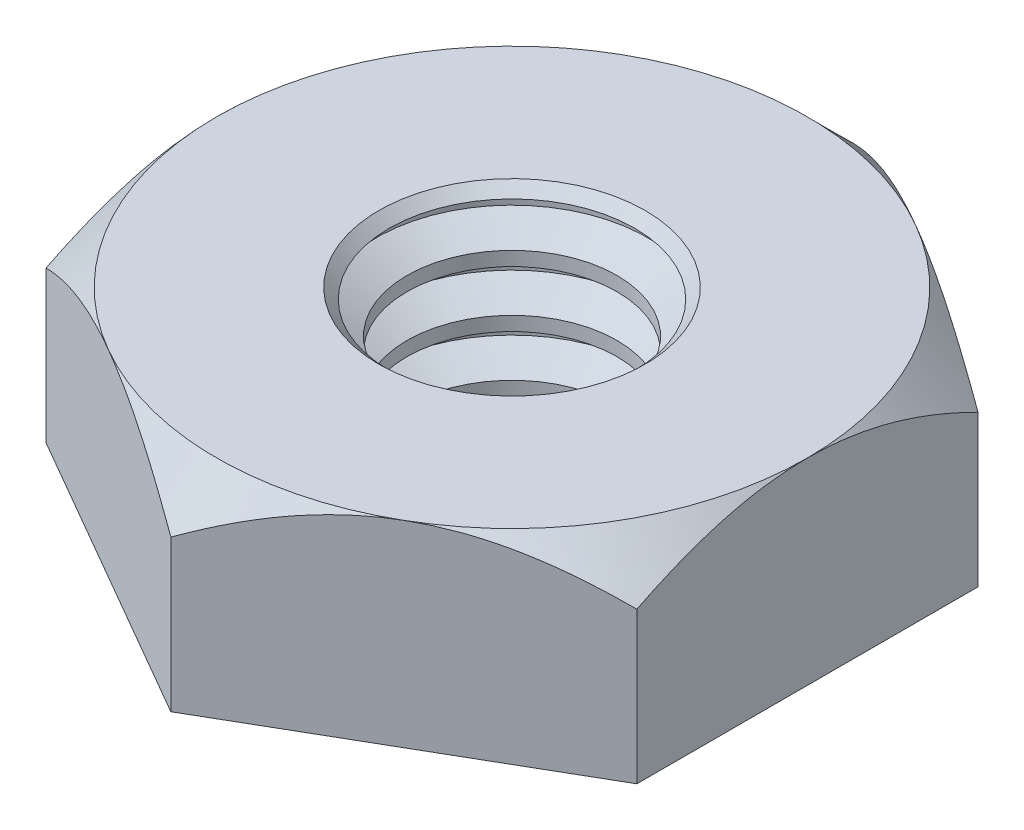
ISO-10303-21;
HEADER;
FILE_DESCRIPTION(('STEP AP214'),'2;1');
FILE_NAME('part.step','',(''),(''),'','','');
FILE_SCHEMA(('AUTOMOTIVE_DESIGN { 1 0 10303 214 1 1 1 1 }'));
ENDSEC;
DATA;
#1=APPLICATION_CONTEXT('core data for automotive mechanical design processes');
#2=APPLICATION_PROTOCOL_DEFINITION('international standard','automotive_design',2000,#1);
#3=PRODUCT_CONTEXT('',#1,'mechanical');
#4=PRODUCT('Part','Part','',(#3));
#5=PRODUCT_RELATED_PRODUCT_CATEGORY('part','',(#4));
#6=PRODUCT_DEFINITION_FORMATION('','',#4);
#7=PRODUCT_DEFINITION_CONTEXT('part definition',#1,'design');
#8=PRODUCT_DEFINITION('design','',#6,#7);
#9=PRODUCT_DEFINITION_SHAPE('','',#8);
#10=(LENGTH_UNIT() NAMED_UNIT(*) SI_UNIT(.MILLI.,.METRE.));
#11=(NAMED_UNIT(*) PLANE_ANGLE_UNIT() SI_UNIT($,.RADIAN.));
#12=(NAMED_UNIT(*) SI_UNIT($,.STERADIAN.) SOLID_ANGLE_UNIT());
#13=UNCERTAINTY_MEASURE_WITH_UNIT(LENGTH_MEASURE(1.E-05),#10,'distance_accuracy_value','');
#14=(GEOMETRIC_REPRESENTATION_CONTEXT(3) GLOBAL_UNCERTAINTY_ASSIGNED_CONTEXT((#13)) GLOBAL_UNIT_ASSIGNED_CONTEXT((#10,
#11,#12)) REPRESENTATION_CONTEXT('',''));
#15=CARTESIAN_POINT('',(0.,0.,0.));
#16=DIRECTION('',(0.,0.,1.));
#17=DIRECTION('',(1.,0.,0.));
#18=AXIS2_PLACEMENT_3D('',#15,#16,#17);
#19=CARTESIAN_POINT('',(0.,0.,-2.7496306570156));
#20=DIRECTION('',(0.,1.,0.));
#21=DIRECTION('',(0.,0.,1.));
#22=AXIS2_PLACEMENT_3D('',#19,#20,#21);
#23=PLANE('',#22);
#24=DIRECTION('',(-0.866025403784439,0.,-0.5));
#25=VECTOR('',#24,1.);
#26=CARTESIAN_POINT('',(2.38125,0.,-1.37481532850781));
#27=LINE('',#26,#25);
#28=CARTESIAN_POINT('',(2.38125,0.,-1.37481532850781));
#29=VERTEX_POINT('',#28);
#30=CARTESIAN_POINT('',(0.,0.,-2.7496306570156));
#31=VERTEX_POINT('',#30);
#32=EDGE_CURVE('E245',#29,#31,#27,.T.);
#33=ORIENTED_EDGE('',*,*,#32,.F.);
#34=DIRECTION('',(0.,0.,-1.));
#35=VECTOR('',#34,1.);
#36=CARTESIAN_POINT('',(2.38125,0.,1.37481532850779));
#37=LINE('',#36,#35);
#38=CARTESIAN_POINT('',(2.38125,0.,1.37481532850779));
#39=VERTEX_POINT('',#38);
#40=EDGE_CURVE('E334',#39,#29,#37,.T.);
#41=ORIENTED_EDGE('',*,*,#40,.F.);
#42=DIRECTION('',(0.866025403784439,0.,-0.5));
#43=VECTOR('',#42,1.);
#44=CARTESIAN_POINT('',(0.,0.,2.74963065701559));
#45=LINE('',#44,#43);
#46=CARTESIAN_POINT('',(0.,0.,2.74963065701559));
#47=VERTEX_POINT('',#46);
#48=EDGE_CURVE('E333',#47,#39,#45,.T.);
#49=ORIENTED_EDGE('',*,*,#48,.F.);
#50=DIRECTION('',(0.866025403784439,0.,0.5));
#51=VECTOR('',#50,1.);
#52=CARTESIAN_POINT('',(-2.38125,0.,1.37481532850779));
#53=LINE('',#52,#51);
#54=CARTESIAN_POINT('',(-2.38125,0.,1.37481532850779));
#55=VERTEX_POINT('',#54);
#56=EDGE_CURVE('E126',#55,#47,#53,.T.);
#57=ORIENTED_EDGE('',*,*,#56,.F.);
#58=DIRECTION('',(0.,0.,1.));
#59=VECTOR('',#58,1.);
#60=CARTESIAN_POINT('',(-2.38125,0.,-1.3748153285078));
#61=LINE('',#60,#59);
#62=CARTESIAN_POINT('',(-2.38125,0.,-1.3748153285078));
#63=VERTEX_POINT('',#62);
#64=EDGE_CURVE('E339',#63,#55,#61,.T.);
#65=ORIENTED_EDGE('',*,*,#64,.F.);
#66=DIRECTION('',(-0.866025403784438,0.,0.500000000000001));
#67=VECTOR('',#66,1.);
#68=CARTESIAN_POINT('',(0.,0.,-2.7496306570156));
#69=LINE('',#68,#67);
#70=EDGE_CURVE('E342',#31,#63,#69,.T.);
#71=ORIENTED_EDGE('',*,*,#70,.F.);
#72=EDGE_LOOP('',(#33,#41,#49,#57,#65,#71));
#73=FACE_BOUND('',#72,.T.);
#74=CARTESIAN_POINT('',(0.,0.,0.));
#75=DIRECTION('',(0.,1.,0.));
#76=DIRECTION('',(0.,0.,1.));
#77=AXIS2_PLACEMENT_3D('',#74,#75,#76);
#78=CIRCLE('',#77,1.04309945255329);
#79=CARTESIAN_POINT('',(0.,0.,1.04309945255329));
#80=VERTEX_POINT('',#79);
#81=EDGE_CURVE('E143',#80,#80,#78,.F.);
#82=ORIENTED_EDGE('',*,*,#81,.F.);
#83=EDGE_LOOP('',(#82));
#84=FACE_BOUND('',#83,.T.);
#85=ADVANCED_FACE('F32',(#73,#84),#23,.F.);
#86=CARTESIAN_POINT('',(0.,1.5875,-2.7496306570156));
#87=DIRECTION('',(0.,1.,0.));
#88=DIRECTION('',(0.,0.,1.));
#89=AXIS2_PLACEMENT_3D('',#86,#87,#88);
#90=PLANE('',#89);
#91=CARTESIAN_POINT('',(0.,1.5875,0.));
#92=DIRECTION('',(0.,1.,0.));
#93=DIRECTION('',(0.,0.,1.));
#94=AXIS2_PLACEMENT_3D('',#91,#92,#93);
#95=CIRCLE('',#94,1.07348297705218);
#96=CARTESIAN_POINT('',(0.,1.5875,1.07348297705218));
#97=VERTEX_POINT('',#96);
#98=EDGE_CURVE('E11',#97,#97,#95,.F.);
#99=ORIENTED_EDGE('',*,*,#98,.T.);
#100=EDGE_LOOP('',(#99));
#101=FACE_BOUND('',#100,.T.);
#102=CARTESIAN_POINT('',(0.,1.5875,0.));
#103=DIRECTION('',(0.,1.,0.));
#104=DIRECTION('',(0.,0.,1.));
#105=AXIS2_PLACEMENT_3D('',#102,#103,#104);
#106=CIRCLE('',#105,2.38125);
#107=CARTESIAN_POINT('',(-1.190625,1.5875,2.06222299276169));
#108=VERTEX_POINT('',#107);
#109=CARTESIAN_POINT('',(1.190625,1.5875,2.06222299276169));
#110=VERTEX_POINT('',#109);
#111=EDGE_CURVE('E108',#108,#110,#106,.T.);
#112=ORIENTED_EDGE('',*,*,#111,.T.);
#113=CARTESIAN_POINT('',(0.,1.5875,0.));
#114=DIRECTION('',(0.,1.,0.));
#115=DIRECTION('',(0.,0.,1.));
#116=AXIS2_PLACEMENT_3D('',#113,#114,#115);
#117=CIRCLE('',#116,2.38125);
#118=CARTESIAN_POINT('',(2.38125,1.5875,0.));
#119=VERTEX_POINT('',#118);
#120=EDGE_CURVE('E48',#110,#119,#117,.T.);
#121=ORIENTED_EDGE('',*,*,#120,.T.);
#122=CARTESIAN_POINT('',(1.190625,1.5875,-2.06222299276169));
#123=VERTEX_POINT('',#122);
#124=EDGE_CURVE('E142',#119,#123,#106,.T.);
#125=ORIENTED_EDGE('',*,*,#124,.T.);
#126=CARTESIAN_POINT('',(-1.190625,1.5875,-2.06222299276169));
#127=VERTEX_POINT('',#126);
#128=EDGE_CURVE('E150',#123,#127,#106,.T.);
#129=ORIENTED_EDGE('',*,*,#128,.T.);
#130=CARTESIAN_POINT('',(-2.38125,1.5875,0.));
#131=VERTEX_POINT('',#130);
#132=EDGE_CURVE('E153',#127,#131,#106,.T.);
#133=ORIENTED_EDGE('',*,*,#132,.T.);
#134=EDGE_CURVE('E141',#131,#108,#106,.T.);
#135=ORIENTED_EDGE('',*,*,#134,.T.);
#136=EDGE_LOOP('',(#112,#121,#125,#129,#133,#135));
#137=FACE_BOUND('',#136,.T.);
#138=ADVANCED_FACE('F160',(#101,#137),#90,.T.);
#139=CARTESIAN_POINT('',(2.38125,1.5875,-1.37481532850781));
#140=DIRECTION('',(-0.5,0.,0.866025403784439));
#141=DIRECTION('',(0.866025403784439,0.,0.5));
#142=AXIS2_PLACEMENT_3D('',#139,#140,#141);
#143=PLANE('',#142);
#144=CARTESIAN_POINT('',(2.38145,1.21900386565717,-1.37469985845397));
#145=CARTESIAN_POINT('',(2.29959321762095,1.26622444627487,-1.42195989379551));
#146=CARTESIAN_POINT('',(2.21636766622824,1.31067176769151,-1.47001018829555));
#147=CARTESIAN_POINT('',(2.04666151916196,1.39205388599882,-1.5679900779874));
#148=CARTESIAN_POINT('',(1.96016478264689,1.42894339988927,-1.61792899209839));
#149=CARTESIAN_POINT('',(1.78574822599095,1.4921359298185,-1.71862843803483));
#150=CARTESIAN_POINT('',(1.69787282881932,1.51859778425492,-1.76936332224702));
#151=CARTESIAN_POINT('',(1.52018740592912,1.55936782736834,-1.87195004898375));
#152=CARTESIAN_POINT('',(1.43038280881412,1.57370645145385,-1.92379875730256));
#153=CARTESIAN_POINT('',(1.27561039686965,1.58664355821429,-2.01315665100182));
#154=CARTESIAN_POINT('',(1.21084255103038,1.58855873833122,-2.05055038423196));
#155=CARTESIAN_POINT('',(1.08141272066442,1.58533272021672,-2.12527673163492));
#156=CARTESIAN_POINT('',(1.01675078120663,1.58018904812731,-2.16260931978719));
#157=CARTESIAN_POINT('',(0.888037451422591,1.56313803211276,-2.2369219953863));
#158=CARTESIAN_POINT('',(0.823986825765133,1.55122312163506,-2.2739016413514));
#159=CARTESIAN_POINT('',(0.696993161094712,1.52128367063236,-2.34722146783424));
#160=CARTESIAN_POINT('',(0.63405003756416,1.50325959846594,-2.38356169714824));
#161=CARTESIAN_POINT('',(0.472823849267805,1.44975053543199,-2.47664568036156));
#162=CARTESIAN_POINT('',(0.37554050871215,1.41023192211222,-2.53281224321903));
#163=CARTESIAN_POINT('',(0.232493937374424,1.3435189994336,-2.61540021968752));
#164=CARTESIAN_POINT('',(0.185353711056031,1.32007913387306,-2.64261664204211));
#165=CARTESIAN_POINT('',(0.0919464736333594,1.27106266632487,-2.69654533571235));
#166=CARTESIAN_POINT('',(0.0456789475031774,1.24548737621755,-2.72325790437834));
#167=CARTESIAN_POINT('',(-0.000199999999999734,1.21900386565717,-2.74974612706944));
#168=B_SPLINE_CURVE_WITH_KNOTS('',3,(#144,#145,#146,#147,#148,#149,#150,#151,#152,#153,#154,
#155,#156,#157,#158,#159,#160,#161,#162,#163,#164,#165,#166,#167),.UNSPECIFIED.,.F.,.F.,(4,2,2,
2,2,2,2,2,2,2,2,4),(0.,0.317196610611949,0.636241461041219,0.950218950629223,1.26340583824126,
1.48752413747844,1.71172100167748,1.93616888974083,2.16059957440838,2.51709639744763,
2.69486147369099,2.87251813383153),.UNSPECIFIED.);
#169=CARTESIAN_POINT('',(2.38125,1.2191193429844,-1.37481532850782));
#170=VERTEX_POINT('',#169);
#171=EDGE_CURVE('E344',#170,#123,#168,.T.);
#172=ORIENTED_EDGE('',*,*,#171,.F.);
#173=DIRECTION('',(0.,-1.,0.));
#174=VECTOR('',#173,1.);
#175=CARTESIAN_POINT('',(2.38125,1.5875,-1.37481532850781));
#176=LINE('',#175,#174);
#177=EDGE_CURVE('E133',#170,#29,#176,.T.);
#178=ORIENTED_EDGE('',*,*,#177,.T.);
#179=ORIENTED_EDGE('',*,*,#32,.T.);
#180=DIRECTION('',(0.,-1.,0.));
#181=VECTOR('',#180,1.);
#182=CARTESIAN_POINT('',(0.,1.5875,-2.7496306570156));
#183=LINE('',#182,#181);
#184=CARTESIAN_POINT('',(0.,1.2191193429844,-2.7496306570156));
#185=VERTEX_POINT('',#184);
#186=EDGE_CURVE('E138',#185,#31,#183,.T.);
#187=ORIENTED_EDGE('',*,*,#186,.F.);
#188=EDGE_CURVE('E216',#123,#185,#168,.T.);
#189=ORIENTED_EDGE('',*,*,#188,.F.);
#190=EDGE_LOOP('',(#172,#178,#179,#187,#189));
#191=FACE_BOUND('',#190,.T.);
#192=ADVANCED_FACE('F34',(#191),#143,.F.);
#193=CARTESIAN_POINT('',(0.,1.5875,-2.7496306570156));
#194=DIRECTION('',(0.500000000000001,0.,0.866025403784438));
#195=DIRECTION('',(0.866025403784438,0.,-0.500000000000001));
#196=AXIS2_PLACEMENT_3D('',#193,#194,#195);
#197=PLANE('',#196);
#198=CARTESIAN_POINT('',(0.000200000000000166,1.21900386565717,-2.74974612706944));
#199=CARTESIAN_POINT('',(-0.0816567823790508,1.26622444627487,-2.7024860917279));
#200=CARTESIAN_POINT('',(-0.164882333771762,1.31067176769151,-2.65443579722786));
#201=CARTESIAN_POINT('',(-0.334588480838043,1.39205388599882,-2.55645590753601));
#202=CARTESIAN_POINT('',(-0.421085217353107,1.42894339988927,-2.50651699342501));
#203=CARTESIAN_POINT('',(-0.595501774009049,1.49213592981849,-2.40581754748858));
#204=CARTESIAN_POINT('',(-0.683377171180682,1.51859778425492,-2.35508266327639));
#205=CARTESIAN_POINT('',(-0.861062594070885,1.55936782736834,-2.25249593653966));
#206=CARTESIAN_POINT('',(-0.950867191185882,1.57370645145385,-2.20064722822085));
#207=CARTESIAN_POINT('',(-1.10563960313035,1.58664355821429,-2.11128933452158));
#208=CARTESIAN_POINT('',(-1.17040744896963,1.58855873833122,-2.07389560129144));
#209=CARTESIAN_POINT('',(-1.29983727933559,1.58533272021672,-1.99916925388849));
#210=CARTESIAN_POINT('',(-1.36449921879337,1.58018904812731,-1.96183666573621));
#211=CARTESIAN_POINT('',(-1.49321254857742,1.56313803211276,-1.8875239901371));
#212=CARTESIAN_POINT('',(-1.55726317423487,1.55122312163507,-1.85054434417201));
#213=CARTESIAN_POINT('',(-1.68425683890529,1.52128367063237,-1.77722451768916));
#214=CARTESIAN_POINT('',(-1.74719996243585,1.50325959846595,-1.74088428837516));
#215=CARTESIAN_POINT('',(-1.9084261507322,1.44975053543199,-1.64780030516184));
#216=CARTESIAN_POINT('',(-2.00570949128785,1.41023192211222,-1.59163374230437));
#217=CARTESIAN_POINT('',(-2.14875606262558,1.3435189994336,-1.50904576583588));
#218=CARTESIAN_POINT('',(-2.19589628894397,1.32007913387307,-1.4818293434813));
#219=CARTESIAN_POINT('',(-2.28930352636664,1.27106266632487,-1.42790064981106));
#220=CARTESIAN_POINT('',(-2.33557105249682,1.24548737621755,-1.40118808114506));
#221=CARTESIAN_POINT('',(-2.38145,1.21900386565717,-1.37469985845397));
#222=B_SPLINE_CURVE_WITH_KNOTS('',3,(#198,#199,#200,#201,#202,#203,#204,#205,#206,#207,#208,
#209,#210,#211,#212,#213,#214,#215,#216,#217,#218,#219,#220,#221),.UNSPECIFIED.,.F.,.F.,(4,2,2,
2,2,2,2,2,2,2,2,4),(0.,0.317196610611952,0.636241461041225,0.950218950629232,1.26340583824127,
1.48752413747846,1.71172100167749,1.93616888974084,2.16059957440839,2.51709639744764,
2.694861473691,2.87251813383154),.UNSPECIFIED.);
#223=EDGE_CURVE('E215',#185,#127,#222,.T.);
#224=ORIENTED_EDGE('',*,*,#223,.F.);
#225=ORIENTED_EDGE('',*,*,#186,.T.);
#226=ORIENTED_EDGE('',*,*,#70,.T.);
#227=DIRECTION('',(0.,-1.,0.));
#228=VECTOR('',#227,1.);
#229=CARTESIAN_POINT('',(-2.38125,1.5875,-1.3748153285078));
#230=LINE('',#229,#228);
#231=CARTESIAN_POINT('',(-2.38125,1.2191193429844,-1.37481532850781));
#232=VERTEX_POINT('',#231);
#233=EDGE_CURVE('E131',#232,#63,#230,.T.);
#234=ORIENTED_EDGE('',*,*,#233,.F.);
#235=EDGE_CURVE('E210',#127,#232,#222,.T.);
#236=ORIENTED_EDGE('',*,*,#235,.F.);
#237=EDGE_LOOP('',(#224,#225,#226,#234,#236));
#238=FACE_BOUND('',#237,.T.);
#239=ADVANCED_FACE('F222',(#238),#197,.F.);
#240=CARTESIAN_POINT('',(-2.38125,1.5875,-1.3748153285078));
#241=DIRECTION('',(1.,0.,0.));
#242=DIRECTION('',(0.,0.,-1.));
#243=AXIS2_PLACEMENT_3D('',#240,#241,#242);
#244=PLANE('',#243);
#245=CARTESIAN_POINT('',(-2.38125,0.240179588906181,-2.86912630394419));
#246=CARTESIAN_POINT('',(-2.38125,0.293506689126681,-2.79980955592461));
#247=CARTESIAN_POINT('',(-2.38125,0.346355938633444,-2.7301193164531));
#248=CARTESIAN_POINT('',(-2.38125,0.450880424075711,-2.58983919614982));
#249=CARTESIAN_POINT('',(-2.38125,0.502555379296196,-2.51924910637501));
#250=CARTESIAN_POINT('',(-2.38125,0.604880705975389,-2.37650077502422));
#251=CARTESIAN_POINT('',(-2.38125,0.655520097364171,-2.30433463685783));
#252=CARTESIAN_POINT('',(-2.38125,0.755036614291812,-2.15880130547659));
#253=CARTESIAN_POINT('',(-2.38125,0.803913861173311,-2.08543419546942));
#254=CARTESIAN_POINT('',(-2.38125,0.902542961805656,-1.93258845780627));
#255=CARTESIAN_POINT('',(-2.38125,0.952152910200805,-1.85301779850509));
#256=CARTESIAN_POINT('',(-2.38125,1.04827866709485,-1.69203159559179));
#257=CARTESIAN_POINT('',(-2.38125,1.09479487864361,-1.61061629415846));
#258=CARTESIAN_POINT('',(-2.38125,1.18376557525143,-1.44588343133112));
#259=CARTESIAN_POINT('',(-2.38125,1.22623141970181,-1.36257205340724));
#260=CARTESIAN_POINT('',(-2.38125,1.30614212570996,-1.19359416640859));
#261=CARTESIAN_POINT('',(-2.38125,1.34358935588907,-1.10792879151245));
#262=CARTESIAN_POINT('',(-2.38125,1.40872452306872,-0.942635039086768));
#263=CARTESIAN_POINT('',(-2.38125,1.4370108001417,-0.86324486347623));
#264=CARTESIAN_POINT('',(-2.38125,1.48722865765993,-0.702441892782966));
#265=CARTESIAN_POINT('',(-2.38125,1.50915983334739,-0.621028969229365));
#266=CARTESIAN_POINT('',(-2.38125,1.54511481952273,-0.458084644425686));
#267=CARTESIAN_POINT('',(-2.38125,1.55928224783569,-0.376585475438002));
#268=CARTESIAN_POINT('',(-2.38125,1.57941416514849,-0.212574622282762));
#269=CARTESIAN_POINT('',(-2.38125,1.5853803560254,-0.1300631517693));
#270=CARTESIAN_POINT('',(-2.38125,1.58860164225672,0.031522259858205));
#271=CARTESIAN_POINT('',(-2.38125,1.58622590278112,0.110588903174689));
#272=CARTESIAN_POINT('',(-2.38125,1.5737417806567,0.268104622589961));
#273=CARTESIAN_POINT('',(-2.38125,1.56363269564102,0.346553641940321));
#274=CARTESIAN_POINT('',(-2.38125,1.53608239112472,0.503598587723649));
#275=CARTESIAN_POINT('',(-2.38125,1.51851172190116,0.582171453187212));
#276=CARTESIAN_POINT('',(-2.38125,1.47701024838173,0.737578750449081));
#277=CARTESIAN_POINT('',(-2.38125,1.45307980531335,0.814413280713858));
#278=CARTESIAN_POINT('',(-2.38125,1.37028997046201,1.05086897592276));
#279=CARTESIAN_POINT('',(-2.38125,1.30223450438981,1.20728049738153));
#280=CARTESIAN_POINT('',(-2.38125,1.18870821735986,1.43619844948697));
#281=CARTESIAN_POINT('',(-2.38125,1.14887086566416,1.51169480576284));
#282=CARTESIAN_POINT('',(-2.38125,1.0661066438325,1.6609787360797));
#283=CARTESIAN_POINT('',(-2.38125,1.02318031702828,1.73476660762932));
#284=CARTESIAN_POINT('',(-2.38125,0.937038433864163,1.87722638325708));
#285=CARTESIAN_POINT('',(-2.38125,0.893941790031278,1.94597101003489));
#286=CARTESIAN_POINT('',(-2.38125,0.805912978151154,2.08228069367819));
#287=CARTESIAN_POINT('',(-2.38125,0.760980672486613,2.14984566156212));
#288=CARTESIAN_POINT('',(-2.38125,0.669974823916356,2.2834054266231));
#289=CARTESIAN_POINT('',(-2.38125,0.62391334034527,2.34940847508033));
#290=CARTESIAN_POINT('',(-2.38125,0.53055562575305,2.48050909903297));
#291=CARTESIAN_POINT('',(-2.38125,0.483259738608898,2.54560691911997));
#292=CARTESIAN_POINT('',(-2.38125,0.435458445142948,2.61032519987917));
#293=B_SPLINE_CURVE_WITH_KNOTS('',3,(#245,#246,#247,#248,#249,#250,#251,#252,#253,#254,#255,
#256,#257,#258,#259,#260,#261,#262,#263,#264,#265,#266,#267,#268,#269,#270,#271,#272,#273,#274,
#275,#276,#277,#278,#279,#280,#281,#282,#283,#284,#285,#286,#287,#288,#289,#290,#291,#292),
.UNSPECIFIED.,.F.,.F.,(4,2,2,2,2,2,2,2,2,2,2,2,2,2,2,2,2,2,2,2,2,2,2,4),(0.,0.262373486076588,
0.524809046422166,0.789269246638219,1.05371120100018,1.33496294182564,1.61617796930576,
1.89657958024649,2.17684838122958,2.42946682102386,2.68210134660699,2.92988953986813,
3.17762630567771,3.41454048769348,3.65147618955809,3.89270212574338,4.13391436351259,
4.64406226241705,4.90012722407799,5.15614725506489,5.39952730752342,5.64292563948722,
5.88436975409123,6.12574731099199),.UNSPECIFIED.);
#294=EDGE_CURVE('E165',#232,#131,#293,.T.);
#295=ORIENTED_EDGE('',*,*,#294,.F.);
#296=ORIENTED_EDGE('',*,*,#233,.T.);
#297=ORIENTED_EDGE('',*,*,#64,.T.);
#298=DIRECTION('',(0.,-1.,0.));
#299=VECTOR('',#298,1.);
#300=CARTESIAN_POINT('',(-2.38125,1.5875,1.37481532850779));
#301=LINE('',#300,#299);
#302=CARTESIAN_POINT('',(-2.38125000000002,1.2191193429844,1.37481532850778));
#303=VERTEX_POINT('',#302);
#304=EDGE_CURVE('E128',#303,#55,#301,.T.);
#305=ORIENTED_EDGE('',*,*,#304,.F.);
#306=EDGE_CURVE('E163',#131,#303,#293,.T.);
#307=ORIENTED_EDGE('',*,*,#306,.F.);
#308=EDGE_LOOP('',(#295,#296,#297,#305,#307));
#309=FACE_BOUND('',#308,.T.);
#310=ADVANCED_FACE('F225',(#309),#244,.F.);
#311=CARTESIAN_POINT('',(-2.38125,1.5875,1.37481532850779));
#312=DIRECTION('',(0.5,0.,-0.866025403784439));
#313=DIRECTION('',(-0.866025403784439,0.,-0.5));
#314=AXIS2_PLACEMENT_3D('',#311,#312,#313);
#315=PLANE('',#314);
#316=CARTESIAN_POINT('',(-2.38145,1.21900386565718,1.37469985845395));
#317=CARTESIAN_POINT('',(-2.29959321762095,1.26622444627488,1.4219598937955));
#318=CARTESIAN_POINT('',(-2.21636766622824,1.31067176769152,1.47001018829553));
#319=CARTESIAN_POINT('',(-2.04666151916196,1.39205388599883,1.56799007798738));
#320=CARTESIAN_POINT('',(-1.9601647826469,1.42894339988927,1.61792899209838));
#321=CARTESIAN_POINT('',(-1.78574822599096,1.4921359298185,1.71862843803482));
#322=CARTESIAN_POINT('',(-1.69787282881932,1.51859778425493,1.769363322247));
#323=CARTESIAN_POINT('',(-1.52018740592912,1.55936782736835,1.87195004898373));
#324=CARTESIAN_POINT('',(-1.43038280881412,1.57370645145386,1.92379875730254));
#325=CARTESIAN_POINT('',(-1.27561039686965,1.5866435582143,2.01315665100181));
#326=CARTESIAN_POINT('',(-1.21084255103038,1.58855873833123,2.05055038423195));
#327=CARTESIAN_POINT('',(-1.08141272066442,1.58533272021673,2.1252767316349));
#328=CARTESIAN_POINT('',(-1.01675078120664,1.58018904812732,2.16260931978718));
#329=CARTESIAN_POINT('',(-0.888037451422593,1.56313803211277,2.23692199538629));
#330=CARTESIAN_POINT('',(-0.823986825765135,1.55122312163508,2.27390164135138));
#331=CARTESIAN_POINT('',(-0.696993161094714,1.52128367063238,2.34722146783423));
#332=CARTESIAN_POINT('',(-0.634050037564163,1.50325959846596,2.38356169714823));
#333=CARTESIAN_POINT('',(-0.472823849267807,1.449750535432,2.47664568036155));
#334=CARTESIAN_POINT('',(-0.375540508712152,1.41023192211223,2.53281224321902));
#335=CARTESIAN_POINT('',(-0.232493937374426,1.34351899943361,2.61540021968751));
#336=CARTESIAN_POINT('',(-0.185353711056032,1.32007913387308,2.64261664204209));
#337=CARTESIAN_POINT('',(-0.0919464736333602,1.27106266632488,2.69654533571233));
#338=CARTESIAN_POINT('',(-0.045678947503178,1.24548737621756,2.72325790437833));
#339=CARTESIAN_POINT('',(0.000199999999999358,1.21900386565718,2.74974612706943));
#340=B_SPLINE_CURVE_WITH_KNOTS('',3,(#316,#317,#318,#319,#320,#321,#322,#323,#324,#325,#326,
#327,#328,#329,#330,#331,#332,#333,#334,#335,#336,#337,#338,#339),.UNSPECIFIED.,.F.,.F.,(4,2,2,
2,2,2,2,2,2,2,2,4),(0.,0.317196610611951,0.636241461041222,0.950218950629227,1.26340583824127,
1.48752413747845,1.71172100167748,1.93616888974083,2.16059957440838,2.51709639744764,
2.69486147369099,2.87251813383154),.UNSPECIFIED.);
#341=EDGE_CURVE('E113',#303,#108,#340,.T.);
#342=ORIENTED_EDGE('',*,*,#341,.F.);
#343=ORIENTED_EDGE('',*,*,#304,.T.);
#344=ORIENTED_EDGE('',*,*,#56,.T.);
#345=DIRECTION('',(0.,-1.,0.));
#346=VECTOR('',#345,1.);
#347=CARTESIAN_POINT('',(0.,1.5875,2.74963065701559));
#348=LINE('',#347,#346);
#349=CARTESIAN_POINT('',(0.,1.2191193429844,2.7496306570156));
#350=VERTEX_POINT('',#349);
#351=EDGE_CURVE('E119',#350,#47,#348,.T.);
#352=ORIENTED_EDGE('',*,*,#351,.F.);
#353=EDGE_CURVE('E104',#108,#350,#340,.T.);
#354=ORIENTED_EDGE('',*,*,#353,.F.);
#355=EDGE_LOOP('',(#342,#343,#344,#352,#354));
#356=FACE_BOUND('',#355,.T.);
#357=ADVANCED_FACE('F124',(#356),#315,.F.);
#358=CARTESIAN_POINT('',(0.,1.5875,2.74963065701559));
#359=DIRECTION('',(-0.5,0.,-0.866025403784439));
#360=DIRECTION('',(-0.866025403784439,0.,0.5));
#361=AXIS2_PLACEMENT_3D('',#358,#359,#360);
#362=PLANE('',#361);
#363=CARTESIAN_POINT('',(-0.000200000000000334,1.21900386565718,2.74974612706943));
#364=CARTESIAN_POINT('',(0.0816567823790502,1.26622444627488,2.70248609172789));
#365=CARTESIAN_POINT('',(0.164882333771761,1.31067176769152,2.65443579722785));
#366=CARTESIAN_POINT('',(0.334588480838041,1.39205388599883,2.556455907536));
#367=CARTESIAN_POINT('',(0.421085217353105,1.42894339988928,2.506516993425));
#368=CARTESIAN_POINT('',(0.595501774009046,1.49213592981851,2.40581754748857));
#369=CARTESIAN_POINT('',(0.683377171180678,1.51859778425493,2.35508266327638));
#370=CARTESIAN_POINT('',(0.86106259407088,1.55936782736835,2.25249593653965));
#371=CARTESIAN_POINT('',(0.950867191185876,1.57370645145386,2.20064722822084));
#372=CARTESIAN_POINT('',(1.10563960313035,1.5866435582143,2.11128933452157));
#373=CARTESIAN_POINT('',(1.17040744896962,1.58855873833123,2.07389560129143));
#374=CARTESIAN_POINT('',(1.29983727933558,1.58533272021673,1.99916925388848));
#375=CARTESIAN_POINT('',(1.36449921879336,1.58018904812732,1.96183666573621));
#376=CARTESIAN_POINT('',(1.49321254857741,1.56313803211277,1.8875239901371));
#377=CARTESIAN_POINT('',(1.55726317423487,1.55122312163508,1.850544344172));
#378=CARTESIAN_POINT('',(1.68425683890529,1.52128367063238,1.77722451768916));
#379=CARTESIAN_POINT('',(1.74719996243584,1.50325959846596,1.74088428837516));
#380=CARTESIAN_POINT('',(1.90842615073219,1.449750535432,1.64780030516184));
#381=CARTESIAN_POINT('',(2.00570949128785,1.41023192211223,1.59163374230436));
#382=CARTESIAN_POINT('',(2.14875606262557,1.34351899943361,1.50904576583587));
#383=CARTESIAN_POINT('',(2.19589628894397,1.32007913387308,1.48182934348129));
#384=CARTESIAN_POINT('',(2.28930352636664,1.27106266632488,1.42790064981105));
#385=CARTESIAN_POINT('',(2.33557105249682,1.24548737621756,1.40118808114505));
#386=CARTESIAN_POINT('',(2.38145,1.21900386565718,1.37469985845396));
#387=B_SPLINE_CURVE_WITH_KNOTS('',3,(#363,#364,#365,#366,#367,#368,#369,#370,#371,#372,#373,
#374,#375,#376,#377,#378,#379,#380,#381,#382,#383,#384,#385,#386),.UNSPECIFIED.,.F.,.F.,(4,2,2,
2,2,2,2,2,2,2,2,4),(0.,0.31719661061195,0.636241461041222,0.950218950629226,1.26340583824126,
1.48752413747845,1.71172100167748,1.93616888974083,2.16059957440838,2.51709639744763,
2.69486147369099,2.87251813383153),.UNSPECIFIED.);
#388=EDGE_CURVE('E107',#350,#110,#387,.T.);
#389=ORIENTED_EDGE('',*,*,#388,.F.);
#390=ORIENTED_EDGE('',*,*,#351,.T.);
#391=ORIENTED_EDGE('',*,*,#48,.T.);
#392=DIRECTION('',(0.,-1.,0.));
#393=VECTOR('',#392,1.);
#394=CARTESIAN_POINT('',(2.38125,1.5875,1.37481532850779));
#395=LINE('',#394,#393);
#396=CARTESIAN_POINT('',(2.38125,1.2191193429844,1.37481532850782));
#397=VERTEX_POINT('',#396);
#398=EDGE_CURVE('E129',#397,#39,#395,.T.);
#399=ORIENTED_EDGE('',*,*,#398,.F.);
#400=EDGE_CURVE('E122',#110,#397,#387,.T.);
#401=ORIENTED_EDGE('',*,*,#400,.F.);
#402=EDGE_LOOP('',(#389,#390,#391,#399,#401));
#403=FACE_BOUND('',#402,.T.);
#404=ADVANCED_FACE('F117',(#403),#362,.F.);
#405=CARTESIAN_POINT('',(2.38125,1.5875,1.37481532850779));
#406=DIRECTION('',(-1.,0.,0.));
#407=DIRECTION('',(0.,0.,1.));
#408=AXIS2_PLACEMENT_3D('',#405,#406,#407);
#409=PLANE('',#408);
#410=CARTESIAN_POINT('',(2.38125,0.240179588906176,-2.8691263039442));
#411=CARTESIAN_POINT('',(2.38125,0.293506689126676,-2.79980955592462));
#412=CARTESIAN_POINT('',(2.38125,0.346355938633439,-2.73011931645311));
#413=CARTESIAN_POINT('',(2.38125,0.450880424075706,-2.58983919614982));
#414=CARTESIAN_POINT('',(2.38125,0.502555379296192,-2.51924910637502));
#415=CARTESIAN_POINT('',(2.38125,0.604880705975386,-2.37650077502423));
#416=CARTESIAN_POINT('',(2.38125,0.655520097364168,-2.30433463685784));
#417=CARTESIAN_POINT('',(2.38125,0.755036614291809,-2.1588013054766));
#418=CARTESIAN_POINT('',(2.38125,0.803913861173308,-2.08543419546942));
#419=CARTESIAN_POINT('',(2.38125,0.902542961805654,-1.93258845780627));
#420=CARTESIAN_POINT('',(2.38125,0.952152910200804,-1.8530177985051));
#421=CARTESIAN_POINT('',(2.38125,1.04827866709485,-1.69203159559179));
#422=CARTESIAN_POINT('',(2.38125,1.09479487864361,-1.61061629415846));
#423=CARTESIAN_POINT('',(2.38125,1.18376557525143,-1.44588343133113));
#424=CARTESIAN_POINT('',(2.38125,1.22623141970181,-1.36257205340725));
#425=CARTESIAN_POINT('',(2.38125,1.30614212570997,-1.19359416640859));
#426=CARTESIAN_POINT('',(2.38125,1.34358935588908,-1.10792879151245));
#427=CARTESIAN_POINT('',(2.38125,1.40872452306873,-0.942635039086772));
#428=CARTESIAN_POINT('',(2.38125,1.43701080014171,-0.863244863476234));
#429=CARTESIAN_POINT('',(2.38125,1.48722865765993,-0.70244189278297));
#430=CARTESIAN_POINT('',(2.38125,1.50915983334739,-0.621028969229369));
#431=CARTESIAN_POINT('',(2.38125,1.54511481952273,-0.45808464442569));
#432=CARTESIAN_POINT('',(2.38125,1.55928224783569,-0.376585475438006));
#433=CARTESIAN_POINT('',(2.38125,1.57941416514849,-0.212574622282766));
#434=CARTESIAN_POINT('',(2.38125,1.58538035602541,-0.130063151769303));
#435=CARTESIAN_POINT('',(2.38125,1.58860164225672,0.0315222598582019));
#436=CARTESIAN_POINT('',(2.38125,1.58622590278112,0.110588903174686));
#437=CARTESIAN_POINT('',(2.38125,1.5737417806567,0.268104622589958));
#438=CARTESIAN_POINT('',(2.38125,1.56363269564102,0.346553641940318));
#439=CARTESIAN_POINT('',(2.38125,1.53608239112472,0.503598587723646));
#440=CARTESIAN_POINT('',(2.38125,1.51851172190117,0.58217145318721));
#441=CARTESIAN_POINT('',(2.38125,1.47701024838173,0.737578750449078));
#442=CARTESIAN_POINT('',(2.38125,1.45307980531336,0.814413280713856));
#443=CARTESIAN_POINT('',(2.38125,1.37028997046202,1.05086897592276));
#444=CARTESIAN_POINT('',(2.38125,1.30223450438981,1.20728049738153));
#445=CARTESIAN_POINT('',(2.38125,1.18870821735987,1.43619844948697));
#446=CARTESIAN_POINT('',(2.38125,1.14887086566416,1.51169480576284));
#447=CARTESIAN_POINT('',(2.38125,1.06610664383251,1.66097873607969));
#448=CARTESIAN_POINT('',(2.38125,1.02318031702829,1.73476660762932));
#449=CARTESIAN_POINT('',(2.38125,0.93703843386417,1.87722638325707));
#450=CARTESIAN_POINT('',(2.38125,0.893941790031285,1.94597101003488));
#451=CARTESIAN_POINT('',(2.38125,0.805912978151162,2.08228069367818));
#452=CARTESIAN_POINT('',(2.38125,0.76098067248662,2.14984566156211));
#453=CARTESIAN_POINT('',(2.38125,0.669974823916364,2.28340542662309));
#454=CARTESIAN_POINT('',(2.38125,0.623913340345278,2.34940847508032));
#455=CARTESIAN_POINT('',(2.38125,0.530555625753058,2.48050909903296));
#456=CARTESIAN_POINT('',(2.38125,0.483259738608906,2.54560691911996));
#457=CARTESIAN_POINT('',(2.38125,0.435458445142958,2.61032519987917));
#458=B_SPLINE_CURVE_WITH_KNOTS('',3,(#410,#411,#412,#413,#414,#415,#416,#417,#418,#419,#420,
#421,#422,#423,#424,#425,#426,#427,#428,#429,#430,#431,#432,#433,#434,#435,#436,#437,#438,#439,
#440,#441,#442,#443,#444,#445,#446,#447,#448,#449,#450,#451,#452,#453,#454,#455,#456,#457),
.UNSPECIFIED.,.F.,.F.,(4,2,2,2,2,2,2,2,2,2,2,2,2,2,2,2,2,2,2,2,2,2,2,4),(0.,0.26237348607659,
0.524809046422169,0.789269246638222,1.05371120100018,1.33496294182565,1.61617796930576,
1.8965795802465,2.17684838122959,2.42946682102387,2.682101346607,2.92988953986814,
3.17762630567772,3.41454048769349,3.6514761895581,3.89270212574339,4.1339143635126,
4.64406226241706,4.900127224078,5.1561472550649,5.39952730752343,5.64292563948723,
5.88436975409124,6.125747310992),.UNSPECIFIED.);
#459=EDGE_CURVE('E325',#397,#119,#458,.F.);
#460=ORIENTED_EDGE('',*,*,#459,.F.);
#461=ORIENTED_EDGE('',*,*,#398,.T.);
#462=ORIENTED_EDGE('',*,*,#40,.T.);
#463=ORIENTED_EDGE('',*,*,#177,.F.);
#464=EDGE_CURVE('E199',#119,#170,#458,.F.);
#465=ORIENTED_EDGE('',*,*,#464,.F.);
#466=EDGE_LOOP('',(#460,#461,#462,#463,#465));
#467=FACE_BOUND('',#466,.T.);
#468=ADVANCED_FACE('F330',(#467),#409,.F.);
#469=CARTESIAN_POINT('',(0.,1.5875,0.));
#470=DIRECTION('',(0.,-1.,0.));
#471=DIRECTION('',(0.,0.,-1.));
#472=AXIS2_PLACEMENT_3D('',#469,#470,#471);
#473=CONICAL_SURFACE('',#472,2.38125,0.785398163397455);
#474=ORIENTED_EDGE('',*,*,#353,.T.);
#475=ORIENTED_EDGE('',*,*,#388,.T.);
#476=ORIENTED_EDGE('',*,*,#111,.F.);
#477=EDGE_LOOP('',(#474,#475,#476));
#478=FACE_BOUND('',#477,.T.);
#479=ADVANCED_FACE('F106',(#478),#473,.T.);
#480=ORIENTED_EDGE('',*,*,#306,.T.);
#481=ORIENTED_EDGE('',*,*,#341,.T.);
#482=ORIENTED_EDGE('',*,*,#134,.F.);
#483=EDGE_LOOP('',(#480,#481,#482));
#484=FACE_BOUND('',#483,.T.);
#485=ADVANCED_FACE('F162',(#484),#473,.T.);
#486=ORIENTED_EDGE('',*,*,#235,.T.);
#487=ORIENTED_EDGE('',*,*,#294,.T.);
#488=ORIENTED_EDGE('',*,*,#132,.F.);
#489=EDGE_LOOP('',(#486,#487,#488));
#490=FACE_BOUND('',#489,.T.);
#491=ADVANCED_FACE('F350',(#490),#473,.T.);
#492=ORIENTED_EDGE('',*,*,#188,.T.);
#493=ORIENTED_EDGE('',*,*,#223,.T.);
#494=ORIENTED_EDGE('',*,*,#128,.F.);
#495=EDGE_LOOP('',(#492,#493,#494));
#496=FACE_BOUND('',#495,.T.);
#497=ADVANCED_FACE('F192',(#496),#473,.T.);
#498=ORIENTED_EDGE('',*,*,#171,.T.);
#499=ORIENTED_EDGE('',*,*,#124,.F.);
#500=ORIENTED_EDGE('',*,*,#464,.T.);
#501=EDGE_LOOP('',(#498,#499,#500));
#502=FACE_BOUND('',#501,.T.);
#503=ADVANCED_FACE('F186',(#502),#473,.T.);
#504=ORIENTED_EDGE('',*,*,#400,.T.);
#505=ORIENTED_EDGE('',*,*,#459,.T.);
#506=ORIENTED_EDGE('',*,*,#120,.F.);
#507=EDGE_LOOP('',(#504,#505,#506));
#508=FACE_BOUND('',#507,.T.);
#509=ADVANCED_FACE('F191',(#508),#473,.T.);
#510=CARTESIAN_POINT('',(0.,1.44575892857143,0.));
#511=DIRECTION('',(0.,-1.,0.));
#512=DIRECTION('',(0.,0.,-1.));
#513=AXIS2_PLACEMENT_3D('',#510,#511,#512);
#514=CONICAL_SURFACE('',#513,1.0922,1.0471975511966);
#515=CARTESIAN_POINT('',(0.,1.50449066735603,0.));
#516=DIRECTION('',(0.,1.,0.));
#517=DIRECTION('',(0.,0.,1.));
#518=AXIS2_PLACEMENT_3D('',#515,#516,#517);
#519=CIRCLE('',#518,0.990473644408207);
#520=CARTESIAN_POINT('',(0.,1.50449066735603,0.990473644408207));
#521=VERTEX_POINT('',#520);
#522=EDGE_CURVE('E41',#521,#521,#519,.T.);
#523=ORIENTED_EDGE('',*,*,#522,.T.);
#524=EDGE_LOOP('',(#523));
#525=FACE_BOUND('',#524,.T.);
#526=CARTESIAN_POINT('',(0.,1.44575892857143,0.));
#527=DIRECTION('',(0.,1.,0.));
#528=DIRECTION('',(0.,0.,1.));
#529=AXIS2_PLACEMENT_3D('',#526,#527,#528);
#530=CIRCLE('',#529,1.0922);
#531=CARTESIAN_POINT('',(0.,1.44575892857143,1.0922));
#532=VERTEX_POINT('',#531);
#533=EDGE_CURVE('E314',#532,#532,#530,.T.);
#534=ORIENTED_EDGE('',*,*,#533,.F.);
#535=EDGE_LOOP('',(#534));
#536=FACE_BOUND('',#535,.T.);
#537=ADVANCED_FACE('F194',(#525,#536),#514,.F.);
#538=CARTESIAN_POINT('',(0.,1.66357854098429,0.));
#539=DIRECTION('',(0.,1.,0.));
#540=DIRECTION('',(0.,0.,1.));
#541=AXIS2_PLACEMENT_3D('',#538,#539,#540);
#542=CYLINDRICAL_SURFACE('',#541,1.0922);
#543=ORIENTED_EDGE('',*,*,#533,.T.);
#544=EDGE_LOOP('',(#543));
#545=FACE_BOUND('',#544,.T.);
#546=CARTESIAN_POINT('',(0.,1.3890625,0.));
#547=DIRECTION('',(0.,1.,0.));
#548=DIRECTION('',(0.,0.,1.));
#549=AXIS2_PLACEMENT_3D('',#546,#547,#548);
#550=CIRCLE('',#549,1.0922);
#551=CARTESIAN_POINT('',(0.,1.3890625,1.0922));
#552=VERTEX_POINT('',#551);
#553=EDGE_CURVE('E317',#552,#552,#550,.T.);
#554=ORIENTED_EDGE('',*,*,#553,.F.);
#555=EDGE_LOOP('',(#554));
#556=FACE_BOUND('',#555,.T.);
#557=ADVANCED_FACE('F304',(#545,#556),#542,.F.);
#558=CARTESIAN_POINT('',(0.,1.24732142857143,0.));
#559=DIRECTION('',(0.,1.,0.));
#560=DIRECTION('',(0.,0.,1.));
#561=AXIS2_PLACEMENT_3D('',#558,#559,#560);
#562=CONICAL_SURFACE('',#561,0.846697262766464,1.0471975511966);
#563=ORIENTED_EDGE('',*,*,#553,.T.);
#564=EDGE_LOOP('',(#563));
#565=FACE_BOUND('',#564,.T.);
#566=CARTESIAN_POINT('',(0.,1.24732142857143,0.));
#567=DIRECTION('',(0.,1.,0.));
#568=DIRECTION('',(0.,0.,1.));
#569=AXIS2_PLACEMENT_3D('',#566,#567,#568);
#570=CIRCLE('',#569,0.846697262766464);
#571=CARTESIAN_POINT('',(0.,1.24732142857143,0.846697262766464));
#572=VERTEX_POINT('',#571);
#573=EDGE_CURVE('E318',#572,#572,#570,.T.);
#574=ORIENTED_EDGE('',*,*,#573,.F.);
#575=EDGE_LOOP('',(#574));
#576=FACE_BOUND('',#575,.T.);
#577=ADVANCED_FACE('F301',(#565,#576),#562,.F.);
#578=CARTESIAN_POINT('',(0.,1.66357854098429,0.));
#579=DIRECTION('',(0.,1.,0.));
#580=DIRECTION('',(0.,0.,1.));
#581=AXIS2_PLACEMENT_3D('',#578,#579,#580);
#582=CYLINDRICAL_SURFACE('',#581,0.846697262766464);
#583=ORIENTED_EDGE('',*,*,#573,.T.);
#584=EDGE_LOOP('',(#583));
#585=FACE_BOUND('',#584,.T.);
#586=CARTESIAN_POINT('',(0.,1.13392857142857,0.));
#587=DIRECTION('',(0.,1.,0.));
#588=DIRECTION('',(0.,0.,1.));
#589=AXIS2_PLACEMENT_3D('',#586,#587,#588);
#590=CIRCLE('',#589,0.846697262766464);
#591=CARTESIAN_POINT('',(0.,1.13392857142857,0.846697262766464));
#592=VERTEX_POINT('',#591);
#593=EDGE_CURVE('E322',#592,#592,#590,.T.);
#594=ORIENTED_EDGE('',*,*,#593,.F.);
#595=EDGE_LOOP('',(#594));
#596=FACE_BOUND('',#595,.T.);
#597=ADVANCED_FACE('F297',(#585,#596),#582,.F.);
#598=CARTESIAN_POINT('',(0.,0.9921875,0.));
#599=DIRECTION('',(0.,-1.,0.));
#600=DIRECTION('',(0.,0.,-1.));
#601=AXIS2_PLACEMENT_3D('',#598,#599,#600);
#602=CONICAL_SURFACE('',#601,1.0922,1.0471975511966);
#603=ORIENTED_EDGE('',*,*,#593,.T.);
#604=EDGE_LOOP('',(#603));
#605=FACE_BOUND('',#604,.T.);
#606=CARTESIAN_POINT('',(0.,0.9921875,0.));
#607=DIRECTION('',(0.,1.,0.));
#608=DIRECTION('',(0.,0.,1.));
#609=AXIS2_PLACEMENT_3D('',#606,#607,#608);
#610=CIRCLE('',#609,1.0922);
#611=CARTESIAN_POINT('',(0.,0.9921875,1.0922));
#612=VERTEX_POINT('',#611);
#613=EDGE_CURVE('E541',#612,#612,#610,.T.);
#614=ORIENTED_EDGE('',*,*,#613,.F.);
#615=EDGE_LOOP('',(#614));
#616=FACE_BOUND('',#615,.T.);
#617=ADVANCED_FACE('F293',(#605,#616),#602,.F.);
#618=CARTESIAN_POINT('',(0.,1.21000711241286,0.));
#619=DIRECTION('',(0.,1.,0.));
#620=DIRECTION('',(0.,0.,1.));
#621=AXIS2_PLACEMENT_3D('',#618,#619,#620);
#622=CYLINDRICAL_SURFACE('',#621,1.0922);
#623=ORIENTED_EDGE('',*,*,#613,.T.);
#624=EDGE_LOOP('',(#623));
#625=FACE_BOUND('',#624,.T.);
#626=CARTESIAN_POINT('',(0.,0.935491071428571,0.));
#627=DIRECTION('',(0.,1.,0.));
#628=DIRECTION('',(0.,0.,1.));
#629=AXIS2_PLACEMENT_3D('',#626,#627,#628);
#630=CIRCLE('',#629,1.0922);
#631=CARTESIAN_POINT('',(0.,0.935491071428571,1.0922));
#632=VERTEX_POINT('',#631);
#633=EDGE_CURVE('E544',#632,#632,#630,.T.);
#634=ORIENTED_EDGE('',*,*,#633,.F.);
#635=EDGE_LOOP('',(#634));
#636=FACE_BOUND('',#635,.T.);
#637=ADVANCED_FACE('F289',(#625,#636),#622,.F.);
#638=CARTESIAN_POINT('',(0.,0.79375,0.));
#639=DIRECTION('',(0.,1.,0.));
#640=DIRECTION('',(0.,0.,1.));
#641=AXIS2_PLACEMENT_3D('',#638,#639,#640);
#642=CONICAL_SURFACE('',#641,0.846697262766464,1.0471975511966);
#643=ORIENTED_EDGE('',*,*,#633,.T.);
#644=EDGE_LOOP('',(#643));
#645=FACE_BOUND('',#644,.T.);
#646=CARTESIAN_POINT('',(0.,0.79375,0.));
#647=DIRECTION('',(0.,1.,0.));
#648=DIRECTION('',(0.,0.,1.));
#649=AXIS2_PLACEMENT_3D('',#646,#647,#648);
#650=CIRCLE('',#649,0.846697262766464);
#651=CARTESIAN_POINT('',(0.,0.79375,0.846697262766464));
#652=VERTEX_POINT('',#651);
#653=EDGE_CURVE('E547',#652,#652,#650,.T.);
#654=ORIENTED_EDGE('',*,*,#653,.F.);
#655=EDGE_LOOP('',(#654));
#656=FACE_BOUND('',#655,.T.);
#657=ADVANCED_FACE('F285',(#645,#656),#642,.F.);
#658=CARTESIAN_POINT('',(0.,1.21000711241286,0.));
#659=DIRECTION('',(0.,1.,0.));
#660=DIRECTION('',(0.,0.,1.));
#661=AXIS2_PLACEMENT_3D('',#658,#659,#660);
#662=CYLINDRICAL_SURFACE('',#661,0.846697262766464);
#663=ORIENTED_EDGE('',*,*,#653,.T.);
#664=EDGE_LOOP('',(#663));
#665=FACE_BOUND('',#664,.T.);
#666=CARTESIAN_POINT('',(0.,0.680357142857142,0.));
#667=DIRECTION('',(0.,1.,0.));
#668=DIRECTION('',(0.,0.,1.));
#669=AXIS2_PLACEMENT_3D('',#666,#667,#668);
#670=CIRCLE('',#669,0.846697262766464);
#671=CARTESIAN_POINT('',(0.,0.680357142857142,0.846697262766464));
#672=VERTEX_POINT('',#671);
#673=EDGE_CURVE('E550',#672,#672,#670,.T.);
#674=ORIENTED_EDGE('',*,*,#673,.F.);
#675=EDGE_LOOP('',(#674));
#676=FACE_BOUND('',#675,.T.);
#677=ADVANCED_FACE('F281',(#665,#676),#662,.F.);
#678=CARTESIAN_POINT('',(0.,0.538616071428571,0.));
#679=DIRECTION('',(0.,-1.,0.));
#680=DIRECTION('',(0.,0.,-1.));
#681=AXIS2_PLACEMENT_3D('',#678,#679,#680);
#682=CONICAL_SURFACE('',#681,1.0922,1.0471975511966);
#683=ORIENTED_EDGE('',*,*,#673,.T.);
#684=EDGE_LOOP('',(#683));
#685=FACE_BOUND('',#684,.T.);
#686=CARTESIAN_POINT('',(0.,0.538616071428571,0.));
#687=DIRECTION('',(0.,1.,0.));
#688=DIRECTION('',(0.,0.,1.));
#689=AXIS2_PLACEMENT_3D('',#686,#687,#688);
#690=CIRCLE('',#689,1.0922);
#691=CARTESIAN_POINT('',(0.,0.538616071428571,1.0922));
#692=VERTEX_POINT('',#691);
#693=EDGE_CURVE('E553',#692,#692,#690,.T.);
#694=ORIENTED_EDGE('',*,*,#693,.F.);
#695=EDGE_LOOP('',(#694));
#696=FACE_BOUND('',#695,.T.);
#697=ADVANCED_FACE('F277',(#685,#696),#682,.F.);
#698=CARTESIAN_POINT('',(0.,0.756435683841436,0.));
#699=DIRECTION('',(0.,1.,0.));
#700=DIRECTION('',(0.,0.,1.));
#701=AXIS2_PLACEMENT_3D('',#698,#699,#700);
#702=CYLINDRICAL_SURFACE('',#701,1.0922);
#703=ORIENTED_EDGE('',*,*,#693,.T.);
#704=EDGE_LOOP('',(#703));
#705=FACE_BOUND('',#704,.T.);
#706=CARTESIAN_POINT('',(0.,0.481919642857143,0.));
#707=DIRECTION('',(0.,1.,0.));
#708=DIRECTION('',(0.,0.,1.));
#709=AXIS2_PLACEMENT_3D('',#706,#707,#708);
#710=CIRCLE('',#709,1.0922);
#711=CARTESIAN_POINT('',(0.,0.481919642857143,1.0922));
#712=VERTEX_POINT('',#711);
#713=EDGE_CURVE('E556',#712,#712,#710,.T.);
#714=ORIENTED_EDGE('',*,*,#713,.F.);
#715=EDGE_LOOP('',(#714));
#716=FACE_BOUND('',#715,.T.);
#717=ADVANCED_FACE('F273',(#705,#716),#702,.F.);
#718=CARTESIAN_POINT('',(0.,0.340178571428571,0.));
#719=DIRECTION('',(0.,1.,0.));
#720=DIRECTION('',(0.,0.,1.));
#721=AXIS2_PLACEMENT_3D('',#718,#719,#720);
#722=CONICAL_SURFACE('',#721,0.846697262766464,1.0471975511966);
#723=ORIENTED_EDGE('',*,*,#713,.T.);
#724=EDGE_LOOP('',(#723));
#725=FACE_BOUND('',#724,.T.);
#726=CARTESIAN_POINT('',(0.,0.340178571428571,0.));
#727=DIRECTION('',(0.,1.,0.));
#728=DIRECTION('',(0.,0.,1.));
#729=AXIS2_PLACEMENT_3D('',#726,#727,#728);
#730=CIRCLE('',#729,0.846697262766464);
#731=CARTESIAN_POINT('',(0.,0.340178571428571,0.846697262766464));
#732=VERTEX_POINT('',#731);
#733=EDGE_CURVE('E145',#732,#732,#730,.T.);
#734=ORIENTED_EDGE('',*,*,#733,.F.);
#735=EDGE_LOOP('',(#734));
#736=FACE_BOUND('',#735,.T.);
#737=ADVANCED_FACE('F261',(#725,#736),#722,.F.);
#738=CARTESIAN_POINT('',(0.,0.756435683841436,0.));
#739=DIRECTION('',(0.,1.,0.));
#740=DIRECTION('',(0.,0.,1.));
#741=AXIS2_PLACEMENT_3D('',#738,#739,#740);
#742=CYLINDRICAL_SURFACE('',#741,0.846697262766464);
#743=ORIENTED_EDGE('',*,*,#733,.T.);
#744=EDGE_LOOP('',(#743));
#745=FACE_BOUND('',#744,.T.);
#746=CARTESIAN_POINT('',(0.,0.226785714285714,0.));
#747=DIRECTION('',(0.,1.,0.));
#748=DIRECTION('',(0.,0.,1.));
#749=AXIS2_PLACEMENT_3D('',#746,#747,#748);
#750=CIRCLE('',#749,0.846697262766464);
#751=CARTESIAN_POINT('',(0.,0.226785714285714,0.846697262766464));
#752=VERTEX_POINT('',#751);
#753=EDGE_CURVE('E146',#752,#752,#750,.T.);
#754=ORIENTED_EDGE('',*,*,#753,.F.);
#755=EDGE_LOOP('',(#754));
#756=FACE_BOUND('',#755,.T.);
#757=ADVANCED_FACE('F251',(#745,#756),#742,.F.);
#758=CARTESIAN_POINT('',(0.,-0.113392857142857,0.));
#759=DIRECTION('',(0.,1.,0.));
#760=DIRECTION('',(0.,0.,1.));
#761=AXIS2_PLACEMENT_3D('',#758,#759,#760);
#762=CONICAL_SURFACE('',#761,0.846697262766464,1.0471975511966);
#763=CARTESIAN_POINT('',(0.,0.0283482142857143,0.));
#764=DIRECTION('',(0.,1.,0.));
#765=DIRECTION('',(0.,0.,1.));
#766=AXIS2_PLACEMENT_3D('',#763,#764,#765);
#767=CIRCLE('',#766,1.0922);
#768=CARTESIAN_POINT('',(0.,0.0283482142857143,1.0922));
#769=VERTEX_POINT('',#768);
#770=EDGE_CURVE('E566',#769,#769,#767,.T.);
#771=ORIENTED_EDGE('',*,*,#770,.T.);
#772=EDGE_LOOP('',(#771));
#773=FACE_BOUND('',#772,.T.);
#774=ORIENTED_EDGE('',*,*,#81,.T.);
#775=EDGE_LOOP('',(#774));
#776=FACE_BOUND('',#775,.T.);
#777=ADVANCED_FACE('F248',(#773,#776),#762,.F.);
#778=CARTESIAN_POINT('',(0.,0.0850446428571428,0.));
#779=DIRECTION('',(0.,-1.,0.));
#780=DIRECTION('',(0.,0.,-1.));
#781=AXIS2_PLACEMENT_3D('',#778,#779,#780);
#782=CONICAL_SURFACE('',#781,1.0922,1.0471975511966);
#783=ORIENTED_EDGE('',*,*,#753,.T.);
#784=EDGE_LOOP('',(#783));
#785=FACE_BOUND('',#784,.T.);
#786=CARTESIAN_POINT('',(0.,0.0850446428571428,0.));
#787=DIRECTION('',(0.,1.,0.));
#788=DIRECTION('',(0.,0.,1.));
#789=AXIS2_PLACEMENT_3D('',#786,#787,#788);
#790=CIRCLE('',#789,1.0922);
#791=CARTESIAN_POINT('',(0.,0.0850446428571428,1.0922));
#792=VERTEX_POINT('',#791);
#793=EDGE_CURVE('E563',#792,#792,#790,.T.);
#794=ORIENTED_EDGE('',*,*,#793,.F.);
#795=EDGE_LOOP('',(#794));
#796=FACE_BOUND('',#795,.T.);
#797=ADVANCED_FACE('F250',(#785,#796),#782,.F.);
#798=CARTESIAN_POINT('',(0.,0.302864255270008,0.));
#799=DIRECTION('',(0.,1.,0.));
#800=DIRECTION('',(0.,0.,1.));
#801=AXIS2_PLACEMENT_3D('',#798,#799,#800);
#802=CYLINDRICAL_SURFACE('',#801,1.0922);
#803=ORIENTED_EDGE('',*,*,#793,.T.);
#804=EDGE_LOOP('',(#803));
#805=FACE_BOUND('',#804,.T.);
#806=ORIENTED_EDGE('',*,*,#770,.F.);
#807=EDGE_LOOP('',(#806));
#808=FACE_BOUND('',#807,.T.);
#809=ADVANCED_FACE('F258',(#805,#808),#802,.F.);
#810=CARTESIAN_POINT('',(0.,1.50449066735603,0.));
#811=DIRECTION('',(0.,1.,0.));
#812=DIRECTION('',(0.,0.,1.));
#813=AXIS2_PLACEMENT_3D('',#810,#811,#812);
#814=CONICAL_SURFACE('',#813,0.990473644408207,0.78539816339745);
#815=ORIENTED_EDGE('',*,*,#98,.F.);
#816=EDGE_LOOP('',(#815));
#817=FACE_BOUND('',#816,.T.);
#818=ORIENTED_EDGE('',*,*,#522,.F.);
#819=EDGE_LOOP('',(#818));
#820=FACE_BOUND('',#819,.T.);
#821=ADVANCED_FACE('F267',(#817,#820),#814,.F.);
#822=CLOSED_SHELL('',(#85,#138,#192,#239,#310,#357,#404,#468,#479,#485,#491,#497,#503,#509,#537,
#557,#577,#597,#617,#637,#657,#677,#697,#717,#737,#757,#777,#797,#809,#821));
#823=MANIFOLD_SOLID_BREP('B2',#822);
#824=ADVANCED_BREP_SHAPE_REPRESENTATION('',(#18,#823),#14);
#825=SHAPE_DEFINITION_REPRESENTATION(#9,#824);
ENDSEC;
END-ISO-10303-21;
